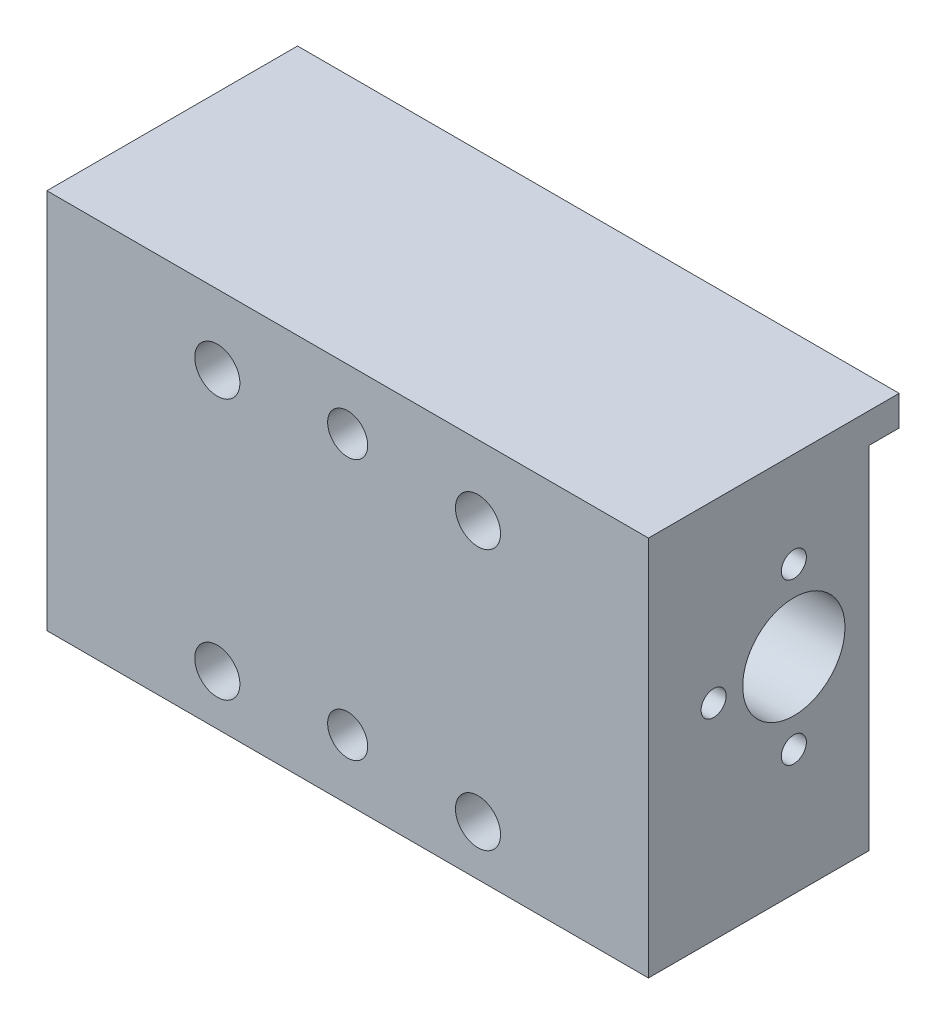
ISO-10303-21;
HEADER;
FILE_DESCRIPTION(('STEP AP214'),'2;1');
FILE_NAME('part.step','',(''),(''),'','','');
FILE_SCHEMA(('AUTOMOTIVE_DESIGN { 1 0 10303 214 1 1 1 1 }'));
ENDSEC;
DATA;
#1=APPLICATION_CONTEXT('core data for automotive mechanical design processes');
#2=APPLICATION_PROTOCOL_DEFINITION('international standard','automotive_design',2000,#1);
#3=PRODUCT_CONTEXT('',#1,'mechanical');
#4=PRODUCT('Part','Part','',(#3));
#5=PRODUCT_RELATED_PRODUCT_CATEGORY('part','',(#4));
#6=PRODUCT_DEFINITION_FORMATION('','',#4);
#7=PRODUCT_DEFINITION_CONTEXT('part definition',#1,'design');
#8=PRODUCT_DEFINITION('design','',#6,#7);
#9=PRODUCT_DEFINITION_SHAPE('','',#8);
#10=(LENGTH_UNIT() NAMED_UNIT(*) SI_UNIT(.MILLI.,.METRE.));
#11=(NAMED_UNIT(*) PLANE_ANGLE_UNIT() SI_UNIT($,.RADIAN.));
#12=(NAMED_UNIT(*) SI_UNIT($,.STERADIAN.) SOLID_ANGLE_UNIT());
#13=UNCERTAINTY_MEASURE_WITH_UNIT(LENGTH_MEASURE(1.E-05),#10,'distance_accuracy_value','');
#14=(GEOMETRIC_REPRESENTATION_CONTEXT(3) GLOBAL_UNCERTAINTY_ASSIGNED_CONTEXT((#13)) GLOBAL_UNIT_ASSIGNED_CONTEXT((#10,
#11,#12)) REPRESENTATION_CONTEXT('',''));
#15=CARTESIAN_POINT('',(0.,0.,0.));
#16=DIRECTION('',(0.,0.,1.));
#17=DIRECTION('',(1.,0.,0.));
#18=AXIS2_PLACEMENT_3D('',#15,#16,#17);
#19=CARTESIAN_POINT('',(0.,0.,22.));
#20=DIRECTION('',(1.,0.,0.));
#21=DIRECTION('',(0.,0.,-1.));
#22=AXIS2_PLACEMENT_3D('',#19,#20,#21);
#23=PLANE('',#22);
#24=CARTESIAN_POINT('',(0.,20.5,7.5));
#25=DIRECTION('',(1.,0.,0.));
#26=DIRECTION('',(0.,0.,-1.));
#27=AXIS2_PLACEMENT_3D('',#24,#25,#26);
#28=CIRCLE('',#27,5.1);
#29=CARTESIAN_POINT('',(0.,20.5,2.4));
#30=VERTEX_POINT('',#29);
#31=EDGE_CURVE('E170',#30,#30,#28,.T.);
#32=ORIENTED_EDGE('',*,*,#31,.T.);
#33=EDGE_LOOP('',(#32));
#34=FACE_BOUND('',#33,.T.);
#35=DIRECTION('',(0.,0.,-1.));
#36=VECTOR('',#35,1.);
#37=CARTESIAN_POINT('',(0.,38.,22.));
#38=LINE('',#37,#36);
#39=CARTESIAN_POINT('',(0.,38.,22.));
#40=VERTEX_POINT('',#39);
#41=CARTESIAN_POINT('',(0.,38.,-3.));
#42=VERTEX_POINT('',#41);
#43=EDGE_CURVE('E183',#40,#42,#38,.T.);
#44=ORIENTED_EDGE('',*,*,#43,.T.);
#45=DIRECTION('',(0.,1.,0.));
#46=VECTOR('',#45,1.);
#47=CARTESIAN_POINT('',(0.,35.,-3.));
#48=LINE('',#47,#46);
#49=CARTESIAN_POINT('',(0.,35.,-3.));
#50=VERTEX_POINT('',#49);
#51=EDGE_CURVE('E144',#50,#42,#48,.T.);
#52=ORIENTED_EDGE('',*,*,#51,.F.);
#53=DIRECTION('',(0.,0.,1.));
#54=VECTOR('',#53,1.);
#55=CARTESIAN_POINT('',(0.,35.,-3.));
#56=LINE('',#55,#54);
#57=CARTESIAN_POINT('',(0.,35.,0.));
#58=VERTEX_POINT('',#57);
#59=EDGE_CURVE('E150',#50,#58,#56,.T.);
#60=ORIENTED_EDGE('',*,*,#59,.T.);
#61=DIRECTION('',(0.,-1.,0.));
#62=VECTOR('',#61,1.);
#63=CARTESIAN_POINT('',(0.,0.,0.));
#64=LINE('',#63,#62);
#65=CARTESIAN_POINT('',(0.,0.,0.));
#66=VERTEX_POINT('',#65);
#67=EDGE_CURVE('E173',#58,#66,#64,.T.);
#68=ORIENTED_EDGE('',*,*,#67,.T.);
#69=DIRECTION('',(0.,0.,-1.));
#70=VECTOR('',#69,1.);
#71=CARTESIAN_POINT('',(0.,0.,22.));
#72=LINE('',#71,#70);
#73=CARTESIAN_POINT('',(0.,0.,22.));
#74=VERTEX_POINT('',#73);
#75=EDGE_CURVE('E11',#74,#66,#72,.T.);
#76=ORIENTED_EDGE('',*,*,#75,.F.);
#77=DIRECTION('',(0.,-1.,0.));
#78=VECTOR('',#77,1.);
#79=CARTESIAN_POINT('',(0.,0.,22.));
#80=LINE('',#79,#78);
#81=EDGE_CURVE('E176',#40,#74,#80,.T.);
#82=ORIENTED_EDGE('',*,*,#81,.F.);
#83=EDGE_LOOP('',(#44,#52,#60,#68,#76,#82));
#84=FACE_BOUND('',#83,.T.);
#85=ADVANCED_FACE('F35',(#34,#84),#23,.F.);
#86=CARTESIAN_POINT('',(0.,0.,22.));
#87=DIRECTION('',(0.,1.,0.));
#88=DIRECTION('',(0.,0.,1.));
#89=AXIS2_PLACEMENT_3D('',#86,#87,#88);
#90=PLANE('',#89);
#91=DIRECTION('',(1.,0.,0.));
#92=VECTOR('',#91,1.);
#93=CARTESIAN_POINT('',(0.,0.,0.));
#94=LINE('',#93,#92);
#95=CARTESIAN_POINT('',(60.,0.,0.));
#96=VERTEX_POINT('',#95);
#97=EDGE_CURVE('E75',#66,#96,#94,.T.);
#98=ORIENTED_EDGE('',*,*,#97,.T.);
#99=DIRECTION('',(0.,0.,-1.));
#100=VECTOR('',#99,1.);
#101=CARTESIAN_POINT('',(60.,0.,22.));
#102=LINE('',#101,#100);
#103=CARTESIAN_POINT('',(60.,0.,22.));
#104=VERTEX_POINT('',#103);
#105=EDGE_CURVE('E43',#104,#96,#102,.T.);
#106=ORIENTED_EDGE('',*,*,#105,.F.);
#107=DIRECTION('',(1.,0.,0.));
#108=VECTOR('',#107,1.);
#109=CARTESIAN_POINT('',(0.,0.,22.));
#110=LINE('',#109,#108);
#111=EDGE_CURVE('E80',#74,#104,#110,.T.);
#112=ORIENTED_EDGE('',*,*,#111,.F.);
#113=ORIENTED_EDGE('',*,*,#75,.T.);
#114=EDGE_LOOP('',(#98,#106,#112,#113));
#115=FACE_BOUND('',#114,.T.);
#116=ADVANCED_FACE('F237',(#115),#90,.F.);
#117=CARTESIAN_POINT('',(60.,0.,22.));
#118=DIRECTION('',(-1.,0.,0.));
#119=DIRECTION('',(0.,0.,1.));
#120=AXIS2_PLACEMENT_3D('',#117,#118,#119);
#121=PLANE('',#120);
#122=CARTESIAN_POINT('',(60.,12.5,7.5));
#123=DIRECTION('',(1.,0.,0.));
#124=DIRECTION('',(0.,0.,-1.));
#125=AXIS2_PLACEMENT_3D('',#122,#123,#124);
#126=CIRCLE('',#125,1.24999999999999);
#127=CARTESIAN_POINT('',(60.,12.5,6.25000000000001));
#128=VERTEX_POINT('',#127);
#129=EDGE_CURVE('E121',#128,#128,#126,.T.);
#130=ORIENTED_EDGE('',*,*,#129,.F.);
#131=EDGE_LOOP('',(#130));
#132=FACE_BOUND('',#131,.T.);
#133=CARTESIAN_POINT('',(60.,28.5,7.5));
#134=DIRECTION('',(1.,0.,0.));
#135=DIRECTION('',(0.,0.,-1.));
#136=AXIS2_PLACEMENT_3D('',#133,#134,#135);
#137=CIRCLE('',#136,1.24999999999999);
#138=CARTESIAN_POINT('',(60.,28.5,6.25000000000001));
#139=VERTEX_POINT('',#138);
#140=EDGE_CURVE('E120',#139,#139,#137,.T.);
#141=ORIENTED_EDGE('',*,*,#140,.F.);
#142=EDGE_LOOP('',(#141));
#143=FACE_BOUND('',#142,.T.);
#144=CARTESIAN_POINT('',(60.,20.5,15.5));
#145=DIRECTION('',(1.,0.,0.));
#146=DIRECTION('',(0.,0.,-1.));
#147=AXIS2_PLACEMENT_3D('',#144,#145,#146);
#148=CIRCLE('',#147,1.24999999999999);
#149=CARTESIAN_POINT('',(60.,20.5,14.25));
#150=VERTEX_POINT('',#149);
#151=EDGE_CURVE('E133',#150,#150,#148,.T.);
#152=ORIENTED_EDGE('',*,*,#151,.F.);
#153=EDGE_LOOP('',(#152));
#154=FACE_BOUND('',#153,.T.);
#155=CARTESIAN_POINT('',(60.,20.5,7.5));
#156=DIRECTION('',(1.,0.,0.));
#157=DIRECTION('',(0.,0.,-1.));
#158=AXIS2_PLACEMENT_3D('',#155,#156,#157);
#159=CIRCLE('',#158,5.1);
#160=CARTESIAN_POINT('',(60.,20.5,2.4));
#161=VERTEX_POINT('',#160);
#162=EDGE_CURVE('E169',#161,#161,#159,.T.);
#163=ORIENTED_EDGE('',*,*,#162,.F.);
#164=EDGE_LOOP('',(#163));
#165=FACE_BOUND('',#164,.T.);
#166=DIRECTION('',(0.,1.,0.));
#167=VECTOR('',#166,1.);
#168=CARTESIAN_POINT('',(60.,0.,0.));
#169=LINE('',#168,#167);
#170=CARTESIAN_POINT('',(60.,35.,0.));
#171=VERTEX_POINT('',#170);
#172=EDGE_CURVE('E178',#96,#171,#169,.T.);
#173=ORIENTED_EDGE('',*,*,#172,.T.);
#174=DIRECTION('',(0.,0.,1.));
#175=VECTOR('',#174,1.);
#176=CARTESIAN_POINT('',(60.,35.,-3.));
#177=LINE('',#176,#175);
#178=CARTESIAN_POINT('',(60.,35.,-3.));
#179=VERTEX_POINT('',#178);
#180=EDGE_CURVE('E154',#179,#171,#177,.T.);
#181=ORIENTED_EDGE('',*,*,#180,.F.);
#182=DIRECTION('',(0.,-1.,0.));
#183=VECTOR('',#182,1.);
#184=CARTESIAN_POINT('',(60.,35.,-3.));
#185=LINE('',#184,#183);
#186=CARTESIAN_POINT('',(60.,38.,-3.));
#187=VERTEX_POINT('',#186);
#188=EDGE_CURVE('E139',#187,#179,#185,.T.);
#189=ORIENTED_EDGE('',*,*,#188,.F.);
#190=DIRECTION('',(0.,0.,-1.));
#191=VECTOR('',#190,1.);
#192=CARTESIAN_POINT('',(60.,38.,22.));
#193=LINE('',#192,#191);
#194=CARTESIAN_POINT('',(60.,38.,22.));
#195=VERTEX_POINT('',#194);
#196=EDGE_CURVE('E188',#195,#187,#193,.T.);
#197=ORIENTED_EDGE('',*,*,#196,.F.);
#198=DIRECTION('',(0.,1.,0.));
#199=VECTOR('',#198,1.);
#200=CARTESIAN_POINT('',(60.,0.,22.));
#201=LINE('',#200,#199);
#202=EDGE_CURVE('E180',#104,#195,#201,.T.);
#203=ORIENTED_EDGE('',*,*,#202,.F.);
#204=ORIENTED_EDGE('',*,*,#105,.T.);
#205=EDGE_LOOP('',(#173,#181,#189,#197,#203,#204));
#206=FACE_BOUND('',#205,.T.);
#207=ADVANCED_FACE('F242',(#132,#143,#154,#165,#206),#121,.F.);
#208=CARTESIAN_POINT('',(0.,38.,22.));
#209=DIRECTION('',(0.,-1.,0.));
#210=DIRECTION('',(0.,0.,-1.));
#211=AXIS2_PLACEMENT_3D('',#208,#209,#210);
#212=PLANE('',#211);
#213=ORIENTED_EDGE('',*,*,#196,.T.);
#214=DIRECTION('',(1.,0.,0.));
#215=VECTOR('',#214,1.);
#216=CARTESIAN_POINT('',(60.,38.,-3.));
#217=LINE('',#216,#215);
#218=EDGE_CURVE('E147',#42,#187,#217,.T.);
#219=ORIENTED_EDGE('',*,*,#218,.F.);
#220=ORIENTED_EDGE('',*,*,#43,.F.);
#221=DIRECTION('',(-1.,0.,0.));
#222=VECTOR('',#221,1.);
#223=CARTESIAN_POINT('',(0.,38.,22.));
#224=LINE('',#223,#222);
#225=EDGE_CURVE('E60',#195,#40,#224,.T.);
#226=ORIENTED_EDGE('',*,*,#225,.F.);
#227=EDGE_LOOP('',(#213,#219,#220,#226));
#228=FACE_BOUND('',#227,.T.);
#229=ADVANCED_FACE('F230',(#228),#212,.F.);
#230=CARTESIAN_POINT('',(0.,0.,22.));
#231=DIRECTION('',(0.,0.,-1.));
#232=DIRECTION('',(-1.,0.,0.));
#233=AXIS2_PLACEMENT_3D('',#230,#231,#232);
#234=PLANE('',#233);
#235=CARTESIAN_POINT('',(43.,5.,22.));
#236=DIRECTION('',(0.,0.,1.));
#237=DIRECTION('',(1.,0.,0.));
#238=AXIS2_PLACEMENT_3D('',#235,#236,#237);
#239=CIRCLE('',#238,2.25);
#240=CARTESIAN_POINT('',(45.25,5.,22.));
#241=VERTEX_POINT('',#240);
#242=EDGE_CURVE('E207',#241,#241,#239,.T.);
#243=ORIENTED_EDGE('',*,*,#242,.F.);
#244=EDGE_LOOP('',(#243));
#245=FACE_BOUND('',#244,.T.);
#246=CARTESIAN_POINT('',(43.,31.,22.));
#247=DIRECTION('',(0.,0.,1.));
#248=DIRECTION('',(1.,0.,0.));
#249=AXIS2_PLACEMENT_3D('',#246,#247,#248);
#250=CIRCLE('',#249,2.25);
#251=CARTESIAN_POINT('',(45.25,31.,22.));
#252=VERTEX_POINT('',#251);
#253=EDGE_CURVE('E197',#252,#252,#250,.T.);
#254=ORIENTED_EDGE('',*,*,#253,.F.);
#255=EDGE_LOOP('',(#254));
#256=FACE_BOUND('',#255,.T.);
#257=CARTESIAN_POINT('',(17.,5.,22.));
#258=DIRECTION('',(0.,0.,1.));
#259=DIRECTION('',(1.,0.,0.));
#260=AXIS2_PLACEMENT_3D('',#257,#258,#259);
#261=CIRCLE('',#260,2.25);
#262=CARTESIAN_POINT('',(19.25,5.,22.));
#263=VERTEX_POINT('',#262);
#264=EDGE_CURVE('E194',#263,#263,#261,.T.);
#265=ORIENTED_EDGE('',*,*,#264,.F.);
#266=EDGE_LOOP('',(#265));
#267=FACE_BOUND('',#266,.T.);
#268=CARTESIAN_POINT('',(17.,31.,22.));
#269=DIRECTION('',(0.,0.,1.));
#270=DIRECTION('',(1.,0.,0.));
#271=AXIS2_PLACEMENT_3D('',#268,#269,#270);
#272=CIRCLE('',#271,2.25);
#273=CARTESIAN_POINT('',(19.25,31.,22.));
#274=VERTEX_POINT('',#273);
#275=EDGE_CURVE('E193',#274,#274,#272,.T.);
#276=ORIENTED_EDGE('',*,*,#275,.F.);
#277=EDGE_LOOP('',(#276));
#278=FACE_BOUND('',#277,.T.);
#279=CARTESIAN_POINT('',(30.,32.,22.));
#280=DIRECTION('',(0.,0.,1.));
#281=DIRECTION('',(1.,0.,0.));
#282=AXIS2_PLACEMENT_3D('',#279,#280,#281);
#283=CIRCLE('',#282,1.99999999999999);
#284=CARTESIAN_POINT('',(32.,32.,22.));
#285=VERTEX_POINT('',#284);
#286=EDGE_CURVE('E157',#285,#285,#283,.T.);
#287=ORIENTED_EDGE('',*,*,#286,.F.);
#288=EDGE_LOOP('',(#287));
#289=FACE_BOUND('',#288,.T.);
#290=CARTESIAN_POINT('',(30.,6.,22.));
#291=DIRECTION('',(0.,0.,1.));
#292=DIRECTION('',(1.,0.,0.));
#293=AXIS2_PLACEMENT_3D('',#290,#291,#292);
#294=CIRCLE('',#293,1.99999999999999);
#295=CARTESIAN_POINT('',(32.,6.,22.));
#296=VERTEX_POINT('',#295);
#297=EDGE_CURVE('E163',#296,#296,#294,.T.);
#298=ORIENTED_EDGE('',*,*,#297,.F.);
#299=EDGE_LOOP('',(#298));
#300=FACE_BOUND('',#299,.T.);
#301=ORIENTED_EDGE('',*,*,#81,.T.);
#302=ORIENTED_EDGE('',*,*,#111,.T.);
#303=ORIENTED_EDGE('',*,*,#202,.T.);
#304=ORIENTED_EDGE('',*,*,#225,.T.);
#305=EDGE_LOOP('',(#301,#302,#303,#304));
#306=FACE_BOUND('',#305,.T.);
#307=ADVANCED_FACE('F220',(#245,#256,#267,#278,#289,#300,#306),#234,.F.);
#308=CARTESIAN_POINT('',(0.,0.,0.));
#309=DIRECTION('',(0.,0.,-1.));
#310=DIRECTION('',(-1.,0.,0.));
#311=AXIS2_PLACEMENT_3D('',#308,#309,#310);
#312=PLANE('',#311);
#313=CARTESIAN_POINT('',(43.,5.,0.));
#314=DIRECTION('',(0.,0.,-1.));
#315=DIRECTION('',(-1.,0.,0.));
#316=AXIS2_PLACEMENT_3D('',#313,#314,#315);
#317=CIRCLE('',#316,2.25);
#318=CARTESIAN_POINT('',(40.75,5.,0.));
#319=VERTEX_POINT('',#318);
#320=EDGE_CURVE('E38',#319,#319,#317,.T.);
#321=ORIENTED_EDGE('',*,*,#320,.F.);
#322=EDGE_LOOP('',(#321));
#323=FACE_BOUND('',#322,.T.);
#324=CARTESIAN_POINT('',(43.,31.,0.));
#325=DIRECTION('',(0.,0.,-1.));
#326=DIRECTION('',(-1.,0.,0.));
#327=AXIS2_PLACEMENT_3D('',#324,#325,#326);
#328=CIRCLE('',#327,2.25);
#329=CARTESIAN_POINT('',(40.75,31.,0.));
#330=VERTEX_POINT('',#329);
#331=EDGE_CURVE('E195',#330,#330,#328,.T.);
#332=ORIENTED_EDGE('',*,*,#331,.F.);
#333=EDGE_LOOP('',(#332));
#334=FACE_BOUND('',#333,.T.);
#335=CARTESIAN_POINT('',(17.,5.,0.));
#336=DIRECTION('',(0.,0.,-1.));
#337=DIRECTION('',(-1.,0.,0.));
#338=AXIS2_PLACEMENT_3D('',#335,#336,#337);
#339=CIRCLE('',#338,2.25);
#340=CARTESIAN_POINT('',(14.75,5.,0.));
#341=VERTEX_POINT('',#340);
#342=EDGE_CURVE('E191',#341,#341,#339,.T.);
#343=ORIENTED_EDGE('',*,*,#342,.F.);
#344=EDGE_LOOP('',(#343));
#345=FACE_BOUND('',#344,.T.);
#346=CARTESIAN_POINT('',(17.,31.,0.));
#347=DIRECTION('',(0.,0.,-1.));
#348=DIRECTION('',(-1.,0.,0.));
#349=AXIS2_PLACEMENT_3D('',#346,#347,#348);
#350=CIRCLE('',#349,2.25);
#351=CARTESIAN_POINT('',(14.75,31.,0.));
#352=VERTEX_POINT('',#351);
#353=EDGE_CURVE('E127',#352,#352,#350,.T.);
#354=ORIENTED_EDGE('',*,*,#353,.F.);
#355=EDGE_LOOP('',(#354));
#356=FACE_BOUND('',#355,.T.);
#357=DIRECTION('',(-1.,0.,0.));
#358=VECTOR('',#357,1.);
#359=CARTESIAN_POINT('',(60.,35.,0.));
#360=LINE('',#359,#358);
#361=EDGE_CURVE('E51',#171,#58,#360,.T.);
#362=ORIENTED_EDGE('',*,*,#361,.F.);
#363=ORIENTED_EDGE('',*,*,#172,.F.);
#364=ORIENTED_EDGE('',*,*,#97,.F.);
#365=ORIENTED_EDGE('',*,*,#67,.F.);
#366=EDGE_LOOP('',(#362,#363,#364,#365));
#367=FACE_BOUND('',#366,.T.);
#368=ADVANCED_FACE('F217',(#323,#334,#345,#356,#367),#312,.T.);
#369=CARTESIAN_POINT('',(0.,20.5,7.5));
#370=DIRECTION('',(1.,0.,0.));
#371=DIRECTION('',(0.,0.,-1.));
#372=AXIS2_PLACEMENT_3D('',#369,#370,#371);
#373=CYLINDRICAL_SURFACE('',#372,5.1);
#374=ORIENTED_EDGE('',*,*,#31,.F.);
#375=EDGE_LOOP('',(#374));
#376=FACE_BOUND('',#375,.T.);
#377=ORIENTED_EDGE('',*,*,#162,.T.);
#378=EDGE_LOOP('',(#377));
#379=FACE_BOUND('',#378,.T.);
#380=ADVANCED_FACE('F219',(#376,#379),#373,.F.);
#381=CARTESIAN_POINT('',(30.,6.,8.));
#382=DIRECTION('',(0.,0.,1.));
#383=DIRECTION('',(1.,0.,0.));
#384=AXIS2_PLACEMENT_3D('',#381,#382,#383);
#385=CONICAL_SURFACE('',#384,1.99999999999999,1.02974425867665);
#386=CARTESIAN_POINT('',(30.,6.,6.79827876194488));
#387=VERTEX_POINT('',#386);
#388=VERTEX_LOOP('',#387);
#389=FACE_BOUND('',#388,.T.);
#390=CARTESIAN_POINT('',(30.,6.,8.));
#391=DIRECTION('',(0.,0.,1.));
#392=DIRECTION('',(1.,0.,0.));
#393=AXIS2_PLACEMENT_3D('',#390,#391,#392);
#394=CIRCLE('',#393,1.99999999999999);
#395=CARTESIAN_POINT('',(32.,6.,8.));
#396=VERTEX_POINT('',#395);
#397=EDGE_CURVE('E166',#396,#396,#394,.T.);
#398=ORIENTED_EDGE('',*,*,#397,.T.);
#399=EDGE_LOOP('',(#398));
#400=FACE_BOUND('',#399,.T.);
#401=ADVANCED_FACE('F227',(#389,#400),#385,.F.);
#402=CARTESIAN_POINT('',(30.,6.,22.));
#403=DIRECTION('',(0.,0.,1.));
#404=DIRECTION('',(1.,0.,0.));
#405=AXIS2_PLACEMENT_3D('',#402,#403,#404);
#406=CYLINDRICAL_SURFACE('',#405,1.99999999999999);
#407=ORIENTED_EDGE('',*,*,#397,.F.);
#408=EDGE_LOOP('',(#407));
#409=FACE_BOUND('',#408,.T.);
#410=ORIENTED_EDGE('',*,*,#297,.T.);
#411=EDGE_LOOP('',(#410));
#412=FACE_BOUND('',#411,.T.);
#413=ADVANCED_FACE('F276',(#409,#412),#406,.F.);
#414=CARTESIAN_POINT('',(30.,32.,8.));
#415=DIRECTION('',(0.,0.,1.));
#416=DIRECTION('',(1.,0.,0.));
#417=AXIS2_PLACEMENT_3D('',#414,#415,#416);
#418=CONICAL_SURFACE('',#417,2.,1.02974425867665);
#419=CARTESIAN_POINT('',(30.,32.,6.79827876194488));
#420=VERTEX_POINT('',#419);
#421=VERTEX_LOOP('',#420);
#422=FACE_BOUND('',#421,.T.);
#423=CARTESIAN_POINT('',(30.,32.,8.));
#424=DIRECTION('',(0.,0.,1.));
#425=DIRECTION('',(1.,0.,0.));
#426=AXIS2_PLACEMENT_3D('',#423,#424,#425);
#427=CIRCLE('',#426,2.);
#428=CARTESIAN_POINT('',(32.,32.,8.));
#429=VERTEX_POINT('',#428);
#430=EDGE_CURVE('E160',#429,#429,#427,.T.);
#431=ORIENTED_EDGE('',*,*,#430,.T.);
#432=EDGE_LOOP('',(#431));
#433=FACE_BOUND('',#432,.T.);
#434=ADVANCED_FACE('F269',(#422,#433),#418,.F.);
#435=CARTESIAN_POINT('',(30.,32.,22.));
#436=DIRECTION('',(0.,0.,1.));
#437=DIRECTION('',(1.,0.,0.));
#438=AXIS2_PLACEMENT_3D('',#435,#436,#437);
#439=CYLINDRICAL_SURFACE('',#438,1.99999999999999);
#440=ORIENTED_EDGE('',*,*,#430,.F.);
#441=EDGE_LOOP('',(#440));
#442=FACE_BOUND('',#441,.T.);
#443=ORIENTED_EDGE('',*,*,#286,.T.);
#444=EDGE_LOOP('',(#443));
#445=FACE_BOUND('',#444,.T.);
#446=ADVANCED_FACE('F261',(#442,#445),#439,.F.);
#447=CARTESIAN_POINT('',(60.,35.,-3.));
#448=DIRECTION('',(0.,1.,0.));
#449=DIRECTION('',(0.,0.,1.));
#450=AXIS2_PLACEMENT_3D('',#447,#448,#449);
#451=PLANE('',#450);
#452=ORIENTED_EDGE('',*,*,#361,.T.);
#453=ORIENTED_EDGE('',*,*,#59,.F.);
#454=DIRECTION('',(-1.,0.,0.));
#455=VECTOR('',#454,1.);
#456=CARTESIAN_POINT('',(60.,35.,-3.));
#457=LINE('',#456,#455);
#458=EDGE_CURVE('E142',#179,#50,#457,.T.);
#459=ORIENTED_EDGE('',*,*,#458,.F.);
#460=ORIENTED_EDGE('',*,*,#180,.T.);
#461=EDGE_LOOP('',(#452,#453,#459,#460));
#462=FACE_BOUND('',#461,.T.);
#463=ADVANCED_FACE('F259',(#462),#451,.F.);
#464=CARTESIAN_POINT('',(0.,0.,-3.));
#465=DIRECTION('',(0.,0.,1.));
#466=DIRECTION('',(1.,0.,0.));
#467=AXIS2_PLACEMENT_3D('',#464,#465,#466);
#468=PLANE('',#467);
#469=ORIENTED_EDGE('',*,*,#188,.T.);
#470=ORIENTED_EDGE('',*,*,#458,.T.);
#471=ORIENTED_EDGE('',*,*,#51,.T.);
#472=ORIENTED_EDGE('',*,*,#218,.T.);
#473=EDGE_LOOP('',(#469,#470,#471,#472));
#474=FACE_BOUND('',#473,.T.);
#475=ADVANCED_FACE('F251',(#474),#468,.F.);
#476=CARTESIAN_POINT('',(46.,20.5,15.5));
#477=DIRECTION('',(1.,0.,0.));
#478=DIRECTION('',(0.,0.,-1.));
#479=AXIS2_PLACEMENT_3D('',#476,#477,#478);
#480=CONICAL_SURFACE('',#479,1.24999999999999,1.02974425867665);
#481=CARTESIAN_POINT('',(45.2489242262156,20.5,15.5));
#482=VERTEX_POINT('',#481);
#483=VERTEX_LOOP('',#482);
#484=FACE_BOUND('',#483,.T.);
#485=CARTESIAN_POINT('',(46.,20.5,15.5));
#486=DIRECTION('',(1.,0.,0.));
#487=DIRECTION('',(0.,0.,-1.));
#488=AXIS2_PLACEMENT_3D('',#485,#486,#487);
#489=CIRCLE('',#488,1.24999999999999);
#490=CARTESIAN_POINT('',(46.,20.5,14.25));
#491=VERTEX_POINT('',#490);
#492=EDGE_CURVE('E136',#491,#491,#489,.T.);
#493=ORIENTED_EDGE('',*,*,#492,.T.);
#494=EDGE_LOOP('',(#493));
#495=FACE_BOUND('',#494,.T.);
#496=ADVANCED_FACE('F267',(#484,#495),#480,.F.);
#497=CARTESIAN_POINT('',(60.,20.5,15.5));
#498=DIRECTION('',(1.,0.,0.));
#499=DIRECTION('',(0.,0.,-1.));
#500=AXIS2_PLACEMENT_3D('',#497,#498,#499);
#501=CYLINDRICAL_SURFACE('',#500,1.24999999999999);
#502=ORIENTED_EDGE('',*,*,#492,.F.);
#503=EDGE_LOOP('',(#502));
#504=FACE_BOUND('',#503,.T.);
#505=ORIENTED_EDGE('',*,*,#151,.T.);
#506=EDGE_LOOP('',(#505));
#507=FACE_BOUND('',#506,.T.);
#508=ADVANCED_FACE('F346',(#504,#507),#501,.F.);
#509=CARTESIAN_POINT('',(46.,28.5,7.5));
#510=DIRECTION('',(1.,0.,0.));
#511=DIRECTION('',(0.,0.,-1.));
#512=AXIS2_PLACEMENT_3D('',#509,#510,#511);
#513=CONICAL_SURFACE('',#512,1.24999999999999,1.02974425867665);
#514=CARTESIAN_POINT('',(45.2489242262156,28.5,7.5));
#515=VERTEX_POINT('',#514);
#516=VERTEX_LOOP('',#515);
#517=FACE_BOUND('',#516,.T.);
#518=CARTESIAN_POINT('',(46.,28.5,7.5));
#519=DIRECTION('',(1.,0.,0.));
#520=DIRECTION('',(0.,0.,-1.));
#521=AXIS2_PLACEMENT_3D('',#518,#519,#520);
#522=CIRCLE('',#521,1.24999999999999);
#523=CARTESIAN_POINT('',(46.,28.5,6.25000000000001));
#524=VERTEX_POINT('',#523);
#525=EDGE_CURVE('E124',#524,#524,#522,.T.);
#526=ORIENTED_EDGE('',*,*,#525,.T.);
#527=EDGE_LOOP('',(#526));
#528=FACE_BOUND('',#527,.T.);
#529=ADVANCED_FACE('F356',(#517,#528),#513,.F.);
#530=CARTESIAN_POINT('',(60.,28.5,7.5));
#531=DIRECTION('',(1.,0.,0.));
#532=DIRECTION('',(0.,0.,-1.));
#533=AXIS2_PLACEMENT_3D('',#530,#531,#532);
#534=CYLINDRICAL_SURFACE('',#533,1.24999999999999);
#535=ORIENTED_EDGE('',*,*,#525,.F.);
#536=EDGE_LOOP('',(#535));
#537=FACE_BOUND('',#536,.T.);
#538=ORIENTED_EDGE('',*,*,#140,.T.);
#539=EDGE_LOOP('',(#538));
#540=FACE_BOUND('',#539,.T.);
#541=ADVANCED_FACE('F114',(#537,#540),#534,.F.);
#542=CARTESIAN_POINT('',(46.,12.5,7.5));
#543=DIRECTION('',(1.,0.,0.));
#544=DIRECTION('',(0.,0.,-1.));
#545=AXIS2_PLACEMENT_3D('',#542,#543,#544);
#546=CONICAL_SURFACE('',#545,1.24999999999999,1.02974425867665);
#547=CARTESIAN_POINT('',(45.2489242262156,12.5,7.5));
#548=VERTEX_POINT('',#547);
#549=VERTEX_LOOP('',#548);
#550=FACE_BOUND('',#549,.T.);
#551=CARTESIAN_POINT('',(46.,12.5,7.5));
#552=DIRECTION('',(1.,0.,0.));
#553=DIRECTION('',(0.,0.,-1.));
#554=AXIS2_PLACEMENT_3D('',#551,#552,#553);
#555=CIRCLE('',#554,1.24999999999999);
#556=CARTESIAN_POINT('',(46.,12.5,6.25000000000001));
#557=VERTEX_POINT('',#556);
#558=EDGE_CURVE('E118',#557,#557,#555,.T.);
#559=ORIENTED_EDGE('',*,*,#558,.T.);
#560=EDGE_LOOP('',(#559));
#561=FACE_BOUND('',#560,.T.);
#562=ADVANCED_FACE('F110',(#550,#561),#546,.F.);
#563=CARTESIAN_POINT('',(60.,12.5,7.5));
#564=DIRECTION('',(1.,0.,0.));
#565=DIRECTION('',(0.,0.,-1.));
#566=AXIS2_PLACEMENT_3D('',#563,#564,#565);
#567=CYLINDRICAL_SURFACE('',#566,1.24999999999999);
#568=ORIENTED_EDGE('',*,*,#558,.F.);
#569=EDGE_LOOP('',(#568));
#570=FACE_BOUND('',#569,.T.);
#571=ORIENTED_EDGE('',*,*,#129,.T.);
#572=EDGE_LOOP('',(#571));
#573=FACE_BOUND('',#572,.T.);
#574=ADVANCED_FACE('F113',(#570,#573),#567,.F.);
#575=CARTESIAN_POINT('',(17.,31.,22.));
#576=DIRECTION('',(0.,0.,1.));
#577=DIRECTION('',(1.,0.,0.));
#578=AXIS2_PLACEMENT_3D('',#575,#576,#577);
#579=CYLINDRICAL_SURFACE('',#578,2.25);
#580=ORIENTED_EDGE('',*,*,#353,.T.);
#581=EDGE_LOOP('',(#580));
#582=FACE_BOUND('',#581,.T.);
#583=ORIENTED_EDGE('',*,*,#275,.T.);
#584=EDGE_LOOP('',(#583));
#585=FACE_BOUND('',#584,.T.);
#586=ADVANCED_FACE('F214',(#582,#585),#579,.F.);
#587=CARTESIAN_POINT('',(17.,5.,22.));
#588=DIRECTION('',(0.,0.,1.));
#589=DIRECTION('',(1.,0.,0.));
#590=AXIS2_PLACEMENT_3D('',#587,#588,#589);
#591=CYLINDRICAL_SURFACE('',#590,2.25);
#592=ORIENTED_EDGE('',*,*,#342,.T.);
#593=EDGE_LOOP('',(#592));
#594=FACE_BOUND('',#593,.T.);
#595=ORIENTED_EDGE('',*,*,#264,.T.);
#596=EDGE_LOOP('',(#595));
#597=FACE_BOUND('',#596,.T.);
#598=ADVANCED_FACE('F412',(#594,#597),#591,.F.);
#599=CARTESIAN_POINT('',(43.,31.,22.));
#600=DIRECTION('',(0.,0.,1.));
#601=DIRECTION('',(1.,0.,0.));
#602=AXIS2_PLACEMENT_3D('',#599,#600,#601);
#603=CYLINDRICAL_SURFACE('',#602,2.25);
#604=ORIENTED_EDGE('',*,*,#331,.T.);
#605=EDGE_LOOP('',(#604));
#606=FACE_BOUND('',#605,.T.);
#607=ORIENTED_EDGE('',*,*,#253,.T.);
#608=EDGE_LOOP('',(#607));
#609=FACE_BOUND('',#608,.T.);
#610=ADVANCED_FACE('F421',(#606,#609),#603,.F.);
#611=CARTESIAN_POINT('',(43.,5.,22.));
#612=DIRECTION('',(0.,0.,1.));
#613=DIRECTION('',(1.,0.,0.));
#614=AXIS2_PLACEMENT_3D('',#611,#612,#613);
#615=CYLINDRICAL_SURFACE('',#614,2.25);
#616=ORIENTED_EDGE('',*,*,#320,.T.);
#617=EDGE_LOOP('',(#616));
#618=FACE_BOUND('',#617,.T.);
#619=ORIENTED_EDGE('',*,*,#242,.T.);
#620=EDGE_LOOP('',(#619));
#621=FACE_BOUND('',#620,.T.);
#622=ADVANCED_FACE('F431',(#618,#621),#615,.F.);
#623=CLOSED_SHELL('',(#85,#116,#207,#229,#307,#368,#380,#401,#413,#434,#446,#463,#475,#496,#508,
#529,#541,#562,#574,#586,#598,#610,#622));
#624=MANIFOLD_SOLID_BREP('B2',#623);
#625=ADVANCED_BREP_SHAPE_REPRESENTATION('',(#18,#624),#14);
#626=SHAPE_DEFINITION_REPRESENTATION(#9,#625);
ENDSEC;
END-ISO-10303-21;
